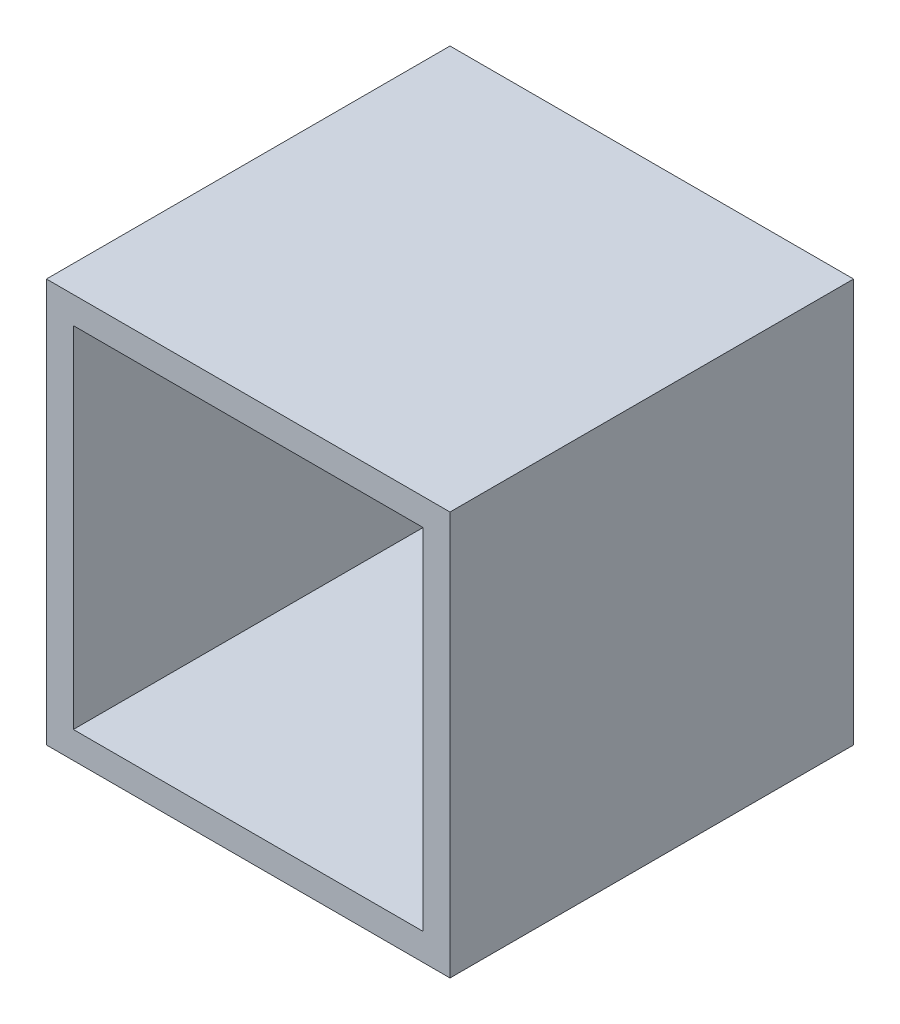
ISO-10303-21;
HEADER;
FILE_DESCRIPTION(('STEP AP214'),'2;1');
FILE_NAME('part.step','',(''),(''),'','','');
FILE_SCHEMA(('AUTOMOTIVE_DESIGN { 1 0 10303 214 1 1 1 1 }'));
ENDSEC;
DATA;
#1=APPLICATION_CONTEXT('core data for automotive mechanical design processes');
#2=APPLICATION_PROTOCOL_DEFINITION('international standard','automotive_design',2000,#1);
#3=PRODUCT_CONTEXT('',#1,'mechanical');
#4=PRODUCT('Part','Part','',(#3));
#5=PRODUCT_RELATED_PRODUCT_CATEGORY('part','',(#4));
#6=PRODUCT_DEFINITION_FORMATION('','',#4);
#7=PRODUCT_DEFINITION_CONTEXT('part definition',#1,'design');
#8=PRODUCT_DEFINITION('design','',#6,#7);
#9=PRODUCT_DEFINITION_SHAPE('','',#8);
#10=(LENGTH_UNIT() NAMED_UNIT(*) SI_UNIT(.MILLI.,.METRE.));
#11=(NAMED_UNIT(*) PLANE_ANGLE_UNIT() SI_UNIT($,.RADIAN.));
#12=(NAMED_UNIT(*) SI_UNIT($,.STERADIAN.) SOLID_ANGLE_UNIT());
#13=UNCERTAINTY_MEASURE_WITH_UNIT(LENGTH_MEASURE(1.E-05),#10,'distance_accuracy_value','');
#14=(GEOMETRIC_REPRESENTATION_CONTEXT(3) GLOBAL_UNCERTAINTY_ASSIGNED_CONTEXT((#13)) GLOBAL_UNIT_ASSIGNED_CONTEXT((#10,
#11,#12)) REPRESENTATION_CONTEXT('',''));
#15=CARTESIAN_POINT('',(0.,0.,0.));
#16=DIRECTION('',(0.,0.,1.));
#17=DIRECTION('',(1.,0.,0.));
#18=AXIS2_PLACEMENT_3D('',#15,#16,#17);
#19=CARTESIAN_POINT('',(-44.3454177137226,128.956732076866,150.));
#20=DIRECTION('',(1.,0.,0.));
#21=DIRECTION('',(0.,1.,0.));
#22=AXIS2_PLACEMENT_3D('',#19,#20,#21);
#23=PLANE('',#22);
#24=DIRECTION('',(0.,-1.,0.));
#25=VECTOR('',#24,1.);
#26=CARTESIAN_POINT('',(-44.3454177137226,128.956732076866,0.));
#27=LINE('',#26,#25);
#28=CARTESIAN_POINT('',(-44.3454177137226,128.956732076866,0.));
#29=VERTEX_POINT('',#28);
#30=CARTESIAN_POINT('',(-44.3454177137226,-21.0432679231338,0.));
#31=VERTEX_POINT('',#30);
#32=EDGE_CURVE('E164',#29,#31,#27,.T.);
#33=ORIENTED_EDGE('',*,*,#32,.T.);
#34=DIRECTION('',(0.,0.,-1.));
#35=VECTOR('',#34,1.);
#36=CARTESIAN_POINT('',(-44.3454177137226,-21.0432679231338,150.));
#37=LINE('',#36,#35);
#38=CARTESIAN_POINT('',(-44.3454177137226,-21.0432679231338,150.));
#39=VERTEX_POINT('',#38);
#40=EDGE_CURVE('E11',#39,#31,#37,.T.);
#41=ORIENTED_EDGE('',*,*,#40,.F.);
#42=DIRECTION('',(0.,-1.,0.));
#43=VECTOR('',#42,1.);
#44=CARTESIAN_POINT('',(-44.3454177137226,128.956732076866,150.));
#45=LINE('',#44,#43);
#46=CARTESIAN_POINT('',(-44.3454177137226,128.956732076866,150.));
#47=VERTEX_POINT('',#46);
#48=EDGE_CURVE('E170',#47,#39,#45,.T.);
#49=ORIENTED_EDGE('',*,*,#48,.F.);
#50=DIRECTION('',(0.,0.,-1.));
#51=VECTOR('',#50,1.);
#52=CARTESIAN_POINT('',(-44.3454177137226,128.956732076866,150.));
#53=LINE('',#52,#51);
#54=EDGE_CURVE('E180',#47,#29,#53,.T.);
#55=ORIENTED_EDGE('',*,*,#54,.T.);
#56=EDGE_LOOP('',(#33,#41,#49,#55));
#57=FACE_BOUND('',#56,.T.);
#58=ADVANCED_FACE('F45',(#57),#23,.F.);
#59=CARTESIAN_POINT('',(-44.3454177137226,-21.0432679231338,150.));
#60=DIRECTION('',(0.,1.,0.));
#61=DIRECTION('',(0.,0.,1.));
#62=AXIS2_PLACEMENT_3D('',#59,#60,#61);
#63=PLANE('',#62);
#64=DIRECTION('',(1.,0.,0.));
#65=VECTOR('',#64,1.);
#66=CARTESIAN_POINT('',(-44.3454177137226,-21.0432679231338,0.));
#67=LINE('',#66,#65);
#68=CARTESIAN_POINT('',(105.654582286277,-21.0432679231338,0.));
#69=VERTEX_POINT('',#68);
#70=EDGE_CURVE('E184',#31,#69,#67,.T.);
#71=ORIENTED_EDGE('',*,*,#70,.T.);
#72=DIRECTION('',(0.,0.,-1.));
#73=VECTOR('',#72,1.);
#74=CARTESIAN_POINT('',(105.654582286277,-21.0432679231338,150.));
#75=LINE('',#74,#73);
#76=CARTESIAN_POINT('',(105.654582286277,-21.0432679231338,150.));
#77=VERTEX_POINT('',#76);
#78=EDGE_CURVE('E53',#77,#69,#75,.T.);
#79=ORIENTED_EDGE('',*,*,#78,.F.);
#80=DIRECTION('',(1.,0.,0.));
#81=VECTOR('',#80,1.);
#82=CARTESIAN_POINT('',(-44.3454177137226,-21.0432679231338,150.));
#83=LINE('',#82,#81);
#84=EDGE_CURVE('E97',#39,#77,#83,.T.);
#85=ORIENTED_EDGE('',*,*,#84,.F.);
#86=ORIENTED_EDGE('',*,*,#40,.T.);
#87=EDGE_LOOP('',(#71,#79,#85,#86));
#88=FACE_BOUND('',#87,.T.);
#89=ADVANCED_FACE('F220',(#88),#63,.F.);
#90=CARTESIAN_POINT('',(105.654582286277,128.956732076866,150.));
#91=DIRECTION('',(-1.,0.,0.));
#92=DIRECTION('',(0.,-1.,0.));
#93=AXIS2_PLACEMENT_3D('',#90,#91,#92);
#94=PLANE('',#93);
#95=DIRECTION('',(0.,1.,0.));
#96=VECTOR('',#95,1.);
#97=CARTESIAN_POINT('',(105.654582286277,128.956732076866,0.));
#98=LINE('',#97,#96);
#99=CARTESIAN_POINT('',(105.654582286277,128.956732076866,0.));
#100=VERTEX_POINT('',#99);
#101=EDGE_CURVE('E187',#69,#100,#98,.T.);
#102=ORIENTED_EDGE('',*,*,#101,.T.);
#103=DIRECTION('',(0.,0.,-1.));
#104=VECTOR('',#103,1.);
#105=CARTESIAN_POINT('',(105.654582286277,128.956732076866,150.));
#106=LINE('',#105,#104);
#107=CARTESIAN_POINT('',(105.654582286277,128.956732076866,150.));
#108=VERTEX_POINT('',#107);
#109=EDGE_CURVE('E194',#108,#100,#106,.T.);
#110=ORIENTED_EDGE('',*,*,#109,.F.);
#111=DIRECTION('',(0.,1.,0.));
#112=VECTOR('',#111,1.);
#113=CARTESIAN_POINT('',(105.654582286277,128.956732076866,150.));
#114=LINE('',#113,#112);
#115=EDGE_CURVE('E175',#77,#108,#114,.T.);
#116=ORIENTED_EDGE('',*,*,#115,.F.);
#117=ORIENTED_EDGE('',*,*,#78,.T.);
#118=EDGE_LOOP('',(#102,#110,#116,#117));
#119=FACE_BOUND('',#118,.T.);
#120=ADVANCED_FACE('F201',(#119),#94,.F.);
#121=CARTESIAN_POINT('',(-44.3454177137226,128.956732076866,150.));
#122=DIRECTION('',(0.,-1.,0.));
#123=DIRECTION('',(0.,0.,-1.));
#124=AXIS2_PLACEMENT_3D('',#121,#122,#123);
#125=PLANE('',#124);
#126=DIRECTION('',(-1.,0.,0.));
#127=VECTOR('',#126,1.);
#128=CARTESIAN_POINT('',(-44.3454177137226,128.956732076866,0.));
#129=LINE('',#128,#127);
#130=EDGE_CURVE('E90',#100,#29,#129,.T.);
#131=ORIENTED_EDGE('',*,*,#130,.T.);
#132=ORIENTED_EDGE('',*,*,#54,.F.);
#133=DIRECTION('',(-1.,0.,0.));
#134=VECTOR('',#133,1.);
#135=CARTESIAN_POINT('',(-44.3454177137226,128.956732076866,150.));
#136=LINE('',#135,#134);
#137=EDGE_CURVE('E69',#108,#47,#136,.T.);
#138=ORIENTED_EDGE('',*,*,#137,.F.);
#139=ORIENTED_EDGE('',*,*,#109,.T.);
#140=EDGE_LOOP('',(#131,#132,#138,#139));
#141=FACE_BOUND('',#140,.T.);
#142=ADVANCED_FACE('F209',(#141),#125,.F.);
#143=CARTESIAN_POINT('',(0.,0.,150.));
#144=DIRECTION('',(0.,0.,1.));
#145=DIRECTION('',(1.,0.,0.));
#146=AXIS2_PLACEMENT_3D('',#143,#144,#145);
#147=PLANE('',#146);
#148=DIRECTION('',(-1.,0.,0.));
#149=VECTOR('',#148,1.);
#150=CARTESIAN_POINT('',(95.6545822862774,118.956732076866,150.));
#151=LINE('',#150,#149);
#152=CARTESIAN_POINT('',(95.6545822862774,118.956732076866,150.));
#153=VERTEX_POINT('',#152);
#154=CARTESIAN_POINT('',(-34.3454177137226,118.956732076866,150.));
#155=VERTEX_POINT('',#154);
#156=EDGE_CURVE('E60',#153,#155,#151,.T.);
#157=ORIENTED_EDGE('',*,*,#156,.F.);
#158=DIRECTION('',(0.,1.,0.));
#159=VECTOR('',#158,1.);
#160=CARTESIAN_POINT('',(95.6545822862774,-11.0432679231338,150.));
#161=LINE('',#160,#159);
#162=CARTESIAN_POINT('',(95.6545822862774,-11.0432679231338,150.));
#163=VERTEX_POINT('',#162);
#164=EDGE_CURVE('E142',#163,#153,#161,.T.);
#165=ORIENTED_EDGE('',*,*,#164,.F.);
#166=DIRECTION('',(1.,0.,0.));
#167=VECTOR('',#166,1.);
#168=CARTESIAN_POINT('',(-34.3454177137226,-11.0432679231338,150.));
#169=LINE('',#168,#167);
#170=CARTESIAN_POINT('',(-34.3454177137226,-11.0432679231338,150.));
#171=VERTEX_POINT('',#170);
#172=EDGE_CURVE('E146',#171,#163,#169,.T.);
#173=ORIENTED_EDGE('',*,*,#172,.F.);
#174=DIRECTION('',(0.,-1.,0.));
#175=VECTOR('',#174,1.);
#176=CARTESIAN_POINT('',(-34.3454177137226,118.956732076866,150.));
#177=LINE('',#176,#175);
#178=EDGE_CURVE('E155',#155,#171,#177,.T.);
#179=ORIENTED_EDGE('',*,*,#178,.F.);
#180=EDGE_LOOP('',(#157,#165,#173,#179));
#181=FACE_BOUND('',#180,.T.);
#182=ORIENTED_EDGE('',*,*,#48,.T.);
#183=ORIENTED_EDGE('',*,*,#84,.T.);
#184=ORIENTED_EDGE('',*,*,#115,.T.);
#185=ORIENTED_EDGE('',*,*,#137,.T.);
#186=EDGE_LOOP('',(#182,#183,#184,#185));
#187=FACE_BOUND('',#186,.T.);
#188=ADVANCED_FACE('F211',(#181,#187),#147,.T.);
#189=CARTESIAN_POINT('',(0.,0.,0.));
#190=DIRECTION('',(0.,0.,1.));
#191=DIRECTION('',(1.,0.,0.));
#192=AXIS2_PLACEMENT_3D('',#189,#190,#191);
#193=PLANE('',#192);
#194=ORIENTED_EDGE('',*,*,#32,.F.);
#195=ORIENTED_EDGE('',*,*,#130,.F.);
#196=ORIENTED_EDGE('',*,*,#101,.F.);
#197=ORIENTED_EDGE('',*,*,#70,.F.);
#198=EDGE_LOOP('',(#194,#195,#196,#197));
#199=FACE_BOUND('',#198,.T.);
#200=ADVANCED_FACE('F205',(#199),#193,.F.);
#201=CARTESIAN_POINT('',(95.6545822862774,118.956732076866,10.));
#202=DIRECTION('',(0.,1.,0.));
#203=DIRECTION('',(0.,0.,1.));
#204=AXIS2_PLACEMENT_3D('',#201,#202,#203);
#205=PLANE('',#204);
#206=ORIENTED_EDGE('',*,*,#156,.T.);
#207=DIRECTION('',(0.,0.,1.));
#208=VECTOR('',#207,1.);
#209=CARTESIAN_POINT('',(-34.3454177137226,118.956732076866,10.));
#210=LINE('',#209,#208);
#211=CARTESIAN_POINT('',(-34.3454177137226,118.956732076866,10.));
#212=VERTEX_POINT('',#211);
#213=EDGE_CURVE('E117',#212,#155,#210,.T.);
#214=ORIENTED_EDGE('',*,*,#213,.F.);
#215=DIRECTION('',(-1.,0.,0.));
#216=VECTOR('',#215,1.);
#217=CARTESIAN_POINT('',(95.6545822862774,118.956732076866,10.));
#218=LINE('',#217,#216);
#219=CARTESIAN_POINT('',(95.6545822862774,118.956732076866,10.));
#220=VERTEX_POINT('',#219);
#221=EDGE_CURVE('E121',#220,#212,#218,.T.);
#222=ORIENTED_EDGE('',*,*,#221,.F.);
#223=DIRECTION('',(0.,0.,1.));
#224=VECTOR('',#223,1.);
#225=CARTESIAN_POINT('',(95.6545822862774,118.956732076866,10.));
#226=LINE('',#225,#224);
#227=EDGE_CURVE('E161',#220,#153,#226,.T.);
#228=ORIENTED_EDGE('',*,*,#227,.T.);
#229=EDGE_LOOP('',(#206,#214,#222,#228));
#230=FACE_BOUND('',#229,.T.);
#231=ADVANCED_FACE('F119',(#230),#205,.F.);
#232=CARTESIAN_POINT('',(95.6545822862774,-11.0432679231338,10.));
#233=DIRECTION('',(1.,0.,0.));
#234=DIRECTION('',(0.,1.,0.));
#235=AXIS2_PLACEMENT_3D('',#232,#233,#234);
#236=PLANE('',#235);
#237=ORIENTED_EDGE('',*,*,#164,.T.);
#238=ORIENTED_EDGE('',*,*,#227,.F.);
#239=DIRECTION('',(0.,1.,0.));
#240=VECTOR('',#239,1.);
#241=CARTESIAN_POINT('',(95.6545822862774,-11.0432679231338,10.));
#242=LINE('',#241,#240);
#243=CARTESIAN_POINT('',(95.6545822862774,-11.0432679231338,10.));
#244=VERTEX_POINT('',#243);
#245=EDGE_CURVE('E128',#244,#220,#242,.T.);
#246=ORIENTED_EDGE('',*,*,#245,.F.);
#247=DIRECTION('',(0.,0.,1.));
#248=VECTOR('',#247,1.);
#249=CARTESIAN_POINT('',(95.6545822862774,-11.0432679231338,10.));
#250=LINE('',#249,#248);
#251=EDGE_CURVE('E165',#244,#163,#250,.T.);
#252=ORIENTED_EDGE('',*,*,#251,.T.);
#253=EDGE_LOOP('',(#237,#238,#246,#252));
#254=FACE_BOUND('',#253,.T.);
#255=ADVANCED_FACE('F260',(#254),#236,.F.);
#256=CARTESIAN_POINT('',(-34.3454177137226,-11.0432679231338,10.));
#257=DIRECTION('',(0.,-1.,0.));
#258=DIRECTION('',(0.,0.,-1.));
#259=AXIS2_PLACEMENT_3D('',#256,#257,#258);
#260=PLANE('',#259);
#261=ORIENTED_EDGE('',*,*,#172,.T.);
#262=ORIENTED_EDGE('',*,*,#251,.F.);
#263=DIRECTION('',(1.,0.,0.));
#264=VECTOR('',#263,1.);
#265=CARTESIAN_POINT('',(-34.3454177137226,-11.0432679231338,10.));
#266=LINE('',#265,#264);
#267=CARTESIAN_POINT('',(-34.3454177137226,-11.0432679231338,10.));
#268=VERTEX_POINT('',#267);
#269=EDGE_CURVE('E137',#268,#244,#266,.T.);
#270=ORIENTED_EDGE('',*,*,#269,.F.);
#271=DIRECTION('',(0.,0.,1.));
#272=VECTOR('',#271,1.);
#273=CARTESIAN_POINT('',(-34.3454177137226,-11.0432679231338,10.));
#274=LINE('',#273,#272);
#275=EDGE_CURVE('E127',#268,#171,#274,.T.);
#276=ORIENTED_EDGE('',*,*,#275,.T.);
#277=EDGE_LOOP('',(#261,#262,#270,#276));
#278=FACE_BOUND('',#277,.T.);
#279=ADVANCED_FACE('F269',(#278),#260,.F.);
#280=CARTESIAN_POINT('',(-34.3454177137226,118.956732076866,10.));
#281=DIRECTION('',(-1.,0.,0.));
#282=DIRECTION('',(0.,-1.,0.));
#283=AXIS2_PLACEMENT_3D('',#280,#281,#282);
#284=PLANE('',#283);
#285=ORIENTED_EDGE('',*,*,#178,.T.);
#286=ORIENTED_EDGE('',*,*,#275,.F.);
#287=DIRECTION('',(0.,-1.,0.));
#288=VECTOR('',#287,1.);
#289=CARTESIAN_POINT('',(-34.3454177137226,118.956732076866,10.));
#290=LINE('',#289,#288);
#291=EDGE_CURVE('E131',#212,#268,#290,.T.);
#292=ORIENTED_EDGE('',*,*,#291,.F.);
#293=ORIENTED_EDGE('',*,*,#213,.T.);
#294=EDGE_LOOP('',(#285,#286,#292,#293));
#295=FACE_BOUND('',#294,.T.);
#296=ADVANCED_FACE('F132',(#295),#284,.F.);
#297=CARTESIAN_POINT('',(0.,0.,10.));
#298=DIRECTION('',(0.,0.,1.));
#299=DIRECTION('',(1.,0.,0.));
#300=AXIS2_PLACEMENT_3D('',#297,#298,#299);
#301=PLANE('',#300);
#302=ORIENTED_EDGE('',*,*,#221,.T.);
#303=ORIENTED_EDGE('',*,*,#291,.T.);
#304=ORIENTED_EDGE('',*,*,#269,.T.);
#305=ORIENTED_EDGE('',*,*,#245,.T.);
#306=EDGE_LOOP('',(#302,#303,#304,#305));
#307=FACE_BOUND('',#306,.T.);
#308=ADVANCED_FACE('F139',(#307),#301,.T.);
#309=CLOSED_SHELL('',(#58,#89,#120,#142,#188,#200,#231,#255,#279,#296,#308));
#310=MANIFOLD_SOLID_BREP('B2',#309);
#311=ADVANCED_BREP_SHAPE_REPRESENTATION('',(#18,#310),#14);
#312=SHAPE_DEFINITION_REPRESENTATION(#9,#311);
ENDSEC;
END-ISO-10303-21;
